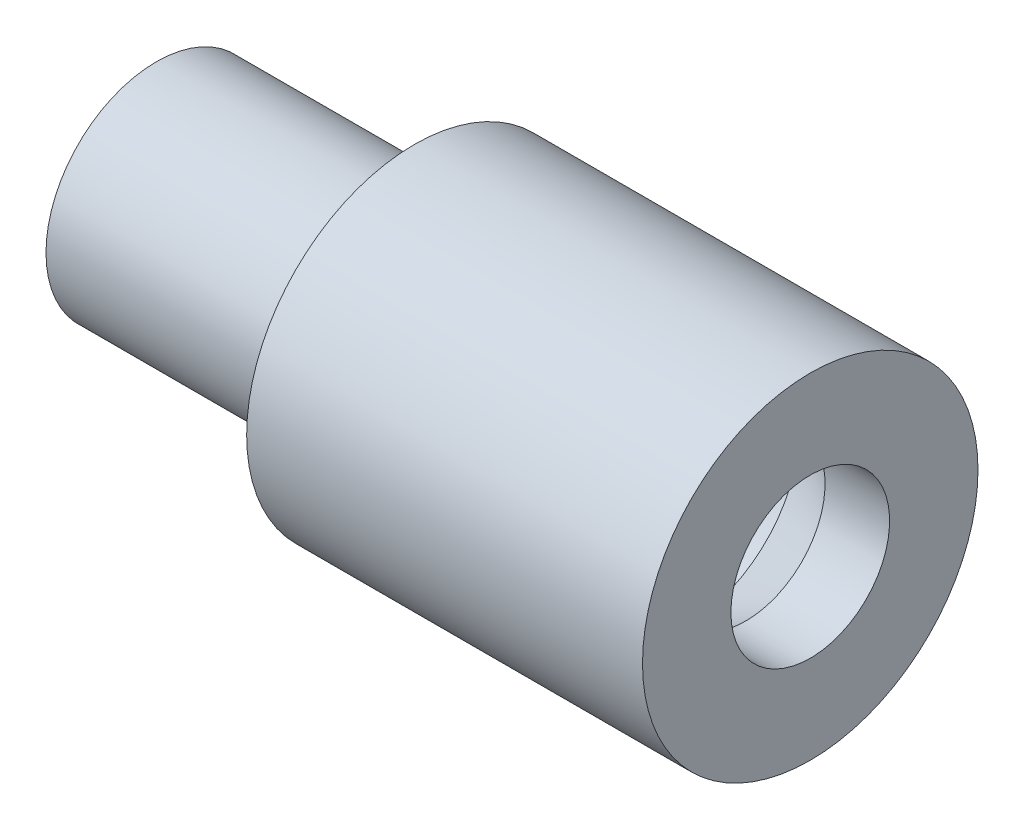
ISO-10303-21;
HEADER;
FILE_DESCRIPTION(('STEP AP214'),'2;1');
FILE_NAME('part.step','',(''),(''),'','','');
FILE_SCHEMA(('AUTOMOTIVE_DESIGN { 1 0 10303 214 1 1 1 1 }'));
ENDSEC;
DATA;
#1=APPLICATION_CONTEXT('core data for automotive mechanical design processes');
#2=APPLICATION_PROTOCOL_DEFINITION('international standard','automotive_design',2000,#1);
#3=PRODUCT_CONTEXT('',#1,'mechanical');
#4=PRODUCT('Part','Part','',(#3));
#5=PRODUCT_RELATED_PRODUCT_CATEGORY('part','',(#4));
#6=PRODUCT_DEFINITION_FORMATION('','',#4);
#7=PRODUCT_DEFINITION_CONTEXT('part definition',#1,'design');
#8=PRODUCT_DEFINITION('design','',#6,#7);
#9=PRODUCT_DEFINITION_SHAPE('','',#8);
#10=(LENGTH_UNIT() NAMED_UNIT(*) SI_UNIT(.MILLI.,.METRE.));
#11=(NAMED_UNIT(*) PLANE_ANGLE_UNIT() SI_UNIT($,.RADIAN.));
#12=(NAMED_UNIT(*) SI_UNIT($,.STERADIAN.) SOLID_ANGLE_UNIT());
#13=UNCERTAINTY_MEASURE_WITH_UNIT(LENGTH_MEASURE(1.E-05),#10,'distance_accuracy_value','');
#14=(GEOMETRIC_REPRESENTATION_CONTEXT(3) GLOBAL_UNCERTAINTY_ASSIGNED_CONTEXT((#13)) GLOBAL_UNIT_ASSIGNED_CONTEXT((#10,
#11,#12)) REPRESENTATION_CONTEXT('',''));
#15=CARTESIAN_POINT('',(0.,0.,0.));
#16=DIRECTION('',(0.,0.,1.));
#17=DIRECTION('',(1.,0.,0.));
#18=AXIS2_PLACEMENT_3D('',#15,#16,#17);
#19=CARTESIAN_POINT('',(0.,0.,0.));
#20=DIRECTION('',(-1.,0.,0.));
#21=DIRECTION('',(0.,0.,1.));
#22=AXIS2_PLACEMENT_3D('',#19,#20,#21);
#23=CYLINDRICAL_SURFACE('',#22,5.15);
#24=CARTESIAN_POINT('',(-1.934375,0.,0.));
#25=DIRECTION('',(-1.,0.,0.));
#26=DIRECTION('',(0.,0.,1.));
#27=AXIS2_PLACEMENT_3D('',#24,#25,#26);
#28=CIRCLE('',#27,5.15);
#29=CARTESIAN_POINT('',(-1.934375,0.,5.15));
#30=VERTEX_POINT('',#29);
#31=EDGE_CURVE('E11',#30,#30,#28,.T.);
#32=ORIENTED_EDGE('',*,*,#31,.F.);
#33=EDGE_LOOP('',(#32));
#34=FACE_BOUND('',#33,.T.);
#35=CARTESIAN_POINT('',(1.934375,0.,0.));
#36=DIRECTION('',(-1.,0.,0.));
#37=DIRECTION('',(0.,0.,1.));
#38=AXIS2_PLACEMENT_3D('',#35,#36,#37);
#39=CIRCLE('',#38,5.15);
#40=CARTESIAN_POINT('',(1.934375,0.,5.15));
#41=VERTEX_POINT('',#40);
#42=EDGE_CURVE('E59',#41,#41,#39,.T.);
#43=ORIENTED_EDGE('',*,*,#42,.T.);
#44=EDGE_LOOP('',(#43));
#45=FACE_BOUND('',#44,.T.);
#46=ADVANCED_FACE('F49',(#34,#45),#23,.T.);
#47=CARTESIAN_POINT('',(-1.934375,0.,0.));
#48=DIRECTION('',(1.,0.,0.));
#49=DIRECTION('',(0.,0.,-1.));
#50=AXIS2_PLACEMENT_3D('',#47,#48,#49);
#51=CONICAL_SURFACE('',#50,5.15,0.412410441597387);
#52=CARTESIAN_POINT('',(-3.934375,0.,0.));
#53=DIRECTION('',(-1.,0.,0.));
#54=DIRECTION('',(0.,0.,1.));
#55=AXIS2_PLACEMENT_3D('',#52,#53,#54);
#56=CIRCLE('',#55,4.275);
#57=CARTESIAN_POINT('',(-3.934375,0.,4.275));
#58=VERTEX_POINT('',#57);
#59=EDGE_CURVE('E55',#58,#58,#56,.T.);
#60=ORIENTED_EDGE('',*,*,#59,.F.);
#61=EDGE_LOOP('',(#60));
#62=FACE_BOUND('',#61,.T.);
#63=ORIENTED_EDGE('',*,*,#31,.T.);
#64=EDGE_LOOP('',(#63));
#65=FACE_BOUND('',#64,.T.);
#66=ADVANCED_FACE('F98',(#62,#65),#51,.T.);
#67=CARTESIAN_POINT('',(0.,0.,0.));
#68=DIRECTION('',(-1.,0.,0.));
#69=DIRECTION('',(0.,0.,1.));
#70=AXIS2_PLACEMENT_3D('',#67,#68,#69);
#71=CYLINDRICAL_SURFACE('',#70,4.275);
#72=ORIENTED_EDGE('',*,*,#59,.T.);
#73=EDGE_LOOP('',(#72));
#74=FACE_BOUND('',#73,.T.);
#75=CARTESIAN_POINT('',(-15.,0.,0.));
#76=DIRECTION('',(1.,0.,0.));
#77=DIRECTION('',(0.,0.,-1.));
#78=AXIS2_PLACEMENT_3D('',#75,#76,#77);
#79=CIRCLE('',#78,4.275);
#80=CARTESIAN_POINT('',(-15.,0.,-4.275));
#81=VERTEX_POINT('',#80);
#82=EDGE_CURVE('E74',#81,#81,#79,.T.);
#83=ORIENTED_EDGE('',*,*,#82,.T.);
#84=EDGE_LOOP('',(#83));
#85=FACE_BOUND('',#84,.T.);
#86=ADVANCED_FACE('F87',(#74,#85),#71,.T.);
#87=CARTESIAN_POINT('',(0.,0.,0.));
#88=DIRECTION('',(-1.,0.,0.));
#89=DIRECTION('',(0.,0.,1.));
#90=AXIS2_PLACEMENT_3D('',#87,#88,#89);
#91=CYLINDRICAL_SURFACE('',#90,3.075);
#92=CARTESIAN_POINT('',(5.,0.,0.));
#93=DIRECTION('',(-1.,0.,0.));
#94=DIRECTION('',(0.,0.,1.));
#95=AXIS2_PLACEMENT_3D('',#92,#93,#94);
#96=CIRCLE('',#95,3.075);
#97=CARTESIAN_POINT('',(5.,0.,3.075));
#98=VERTEX_POINT('',#97);
#99=EDGE_CURVE('E71',#98,#98,#96,.T.);
#100=ORIENTED_EDGE('',*,*,#99,.F.);
#101=EDGE_LOOP('',(#100));
#102=FACE_BOUND('',#101,.T.);
#103=CARTESIAN_POINT('',(-15.,0.,0.));
#104=DIRECTION('',(1.,0.,0.));
#105=DIRECTION('',(0.,0.,-1.));
#106=AXIS2_PLACEMENT_3D('',#103,#104,#105);
#107=CIRCLE('',#106,3.075);
#108=CARTESIAN_POINT('',(-15.,0.,-3.075));
#109=VERTEX_POINT('',#108);
#110=EDGE_CURVE('E77',#109,#109,#107,.T.);
#111=ORIENTED_EDGE('',*,*,#110,.F.);
#112=EDGE_LOOP('',(#111));
#113=FACE_BOUND('',#112,.T.);
#114=ADVANCED_FACE('F84',(#102,#113),#91,.F.);
#115=CARTESIAN_POINT('',(1.934375,0.,0.));
#116=DIRECTION('',(-1.,0.,0.));
#117=DIRECTION('',(0.,0.,-1.));
#118=AXIS2_PLACEMENT_3D('',#115,#116,#117);
#119=CONICAL_SURFACE('',#118,5.15,0.412410441597387);
#120=CARTESIAN_POINT('',(3.934375,0.,0.));
#121=DIRECTION('',(-1.,0.,0.));
#122=DIRECTION('',(0.,0.,1.));
#123=AXIS2_PLACEMENT_3D('',#120,#121,#122);
#124=CIRCLE('',#123,4.275);
#125=CARTESIAN_POINT('',(3.934375,0.,4.275));
#126=VERTEX_POINT('',#125);
#127=EDGE_CURVE('E63',#126,#126,#124,.T.);
#128=ORIENTED_EDGE('',*,*,#127,.T.);
#129=EDGE_LOOP('',(#128));
#130=FACE_BOUND('',#129,.T.);
#131=ORIENTED_EDGE('',*,*,#42,.F.);
#132=EDGE_LOOP('',(#131));
#133=FACE_BOUND('',#132,.T.);
#134=ADVANCED_FACE('F86',(#130,#133),#119,.T.);
#135=CARTESIAN_POINT('',(0.,0.,0.));
#136=DIRECTION('',(1.,0.,0.));
#137=DIRECTION('',(0.,0.,1.));
#138=AXIS2_PLACEMENT_3D('',#135,#136,#137);
#139=CYLINDRICAL_SURFACE('',#138,4.275);
#140=CARTESIAN_POINT('',(5.,0.,0.));
#141=DIRECTION('',(-1.,0.,0.));
#142=DIRECTION('',(0.,0.,1.));
#143=AXIS2_PLACEMENT_3D('',#140,#141,#142);
#144=CIRCLE('',#143,4.275);
#145=CARTESIAN_POINT('',(5.,0.,4.275));
#146=VERTEX_POINT('',#145);
#147=EDGE_CURVE('E68',#146,#146,#144,.T.);
#148=ORIENTED_EDGE('',*,*,#147,.T.);
#149=EDGE_LOOP('',(#148));
#150=FACE_BOUND('',#149,.T.);
#151=ORIENTED_EDGE('',*,*,#127,.F.);
#152=EDGE_LOOP('',(#151));
#153=FACE_BOUND('',#152,.T.);
#154=ADVANCED_FACE('F95',(#150,#153),#139,.T.);
#155=CARTESIAN_POINT('',(5.,0.,-4.275));
#156=DIRECTION('',(-1.,0.,0.));
#157=DIRECTION('',(0.,0.,-1.));
#158=AXIS2_PLACEMENT_3D('',#155,#156,#157);
#159=PLANE('',#158);
#160=ORIENTED_EDGE('',*,*,#99,.T.);
#161=EDGE_LOOP('',(#160));
#162=FACE_BOUND('',#161,.T.);
#163=ORIENTED_EDGE('',*,*,#147,.F.);
#164=EDGE_LOOP('',(#163));
#165=FACE_BOUND('',#164,.T.);
#166=ADVANCED_FACE('F147',(#162,#165),#159,.F.);
#167=CARTESIAN_POINT('',(-15.,0.,0.));
#168=DIRECTION('',(-1.,0.,0.));
#169=DIRECTION('',(0.,0.,1.));
#170=AXIS2_PLACEMENT_3D('',#167,#168,#169);
#171=PLANE('',#170);
#172=ORIENTED_EDGE('',*,*,#110,.T.);
#173=EDGE_LOOP('',(#172));
#174=FACE_BOUND('',#173,.T.);
#175=ORIENTED_EDGE('',*,*,#82,.F.);
#176=EDGE_LOOP('',(#175));
#177=FACE_BOUND('',#176,.T.);
#178=ADVANCED_FACE('F81',(#174,#177),#171,.T.);
#179=CLOSED_SHELL('',(#46,#66,#86,#114,#134,#154,#166,#178));
#180=MANIFOLD_SOLID_BREP('B2',#179);
#181=CARTESIAN_POINT('',(0.,0.,0.));
#182=DIRECTION('',(-1.,0.,0.));
#183=DIRECTION('',(0.,0.,1.));
#184=AXIS2_PLACEMENT_3D('',#181,#182,#183);
#185=CYLINDRICAL_SURFACE('',#184,5.3);
#186=CARTESIAN_POINT('',(-2.,0.,0.));
#187=DIRECTION('',(-1.,0.,0.));
#188=DIRECTION('',(0.,0.,1.));
#189=AXIS2_PLACEMENT_3D('',#186,#187,#188);
#190=CIRCLE('',#189,5.3);
#191=CARTESIAN_POINT('',(-2.,0.,5.3));
#192=VERTEX_POINT('',#191);
#193=EDGE_CURVE('E48',#192,#192,#190,.T.);
#194=ORIENTED_EDGE('',*,*,#193,.T.);
#195=EDGE_LOOP('',(#194));
#196=FACE_BOUND('',#195,.T.);
#197=CARTESIAN_POINT('',(2.,0.,0.));
#198=DIRECTION('',(-1.,0.,0.));
#199=DIRECTION('',(0.,0.,1.));
#200=AXIS2_PLACEMENT_3D('',#197,#198,#199);
#201=CIRCLE('',#200,5.3);
#202=CARTESIAN_POINT('',(2.,0.,5.3));
#203=VERTEX_POINT('',#202);
#204=EDGE_CURVE('E196',#203,#203,#201,.T.);
#205=ORIENTED_EDGE('',*,*,#204,.F.);
#206=EDGE_LOOP('',(#205));
#207=FACE_BOUND('',#206,.T.);
#208=ADVANCED_FACE('F177',(#196,#207),#185,.F.);
#209=CARTESIAN_POINT('',(-4.,0.,0.));
#210=DIRECTION('',(1.,0.,0.));
#211=DIRECTION('',(0.,0.,-1.));
#212=AXIS2_PLACEMENT_3D('',#209,#210,#211);
#213=CONICAL_SURFACE('',#212,4.425,0.412410441597387);
#214=ORIENTED_EDGE('',*,*,#193,.F.);
#215=EDGE_LOOP('',(#214));
#216=FACE_BOUND('',#215,.T.);
#217=CARTESIAN_POINT('',(-4.,0.,0.));
#218=DIRECTION('',(-1.,0.,0.));
#219=DIRECTION('',(0.,0.,1.));
#220=AXIS2_PLACEMENT_3D('',#217,#218,#219);
#221=CIRCLE('',#220,4.425);
#222=CARTESIAN_POINT('',(-4.,0.,4.425));
#223=VERTEX_POINT('',#222);
#224=EDGE_CURVE('E183',#223,#223,#221,.T.);
#225=ORIENTED_EDGE('',*,*,#224,.T.);
#226=EDGE_LOOP('',(#225));
#227=FACE_BOUND('',#226,.T.);
#228=ADVANCED_FACE('F247',(#216,#227),#213,.F.);
#229=CARTESIAN_POINT('',(0.,0.,0.));
#230=DIRECTION('',(-1.,0.,0.));
#231=DIRECTION('',(0.,0.,1.));
#232=AXIS2_PLACEMENT_3D('',#229,#230,#231);
#233=CYLINDRICAL_SURFACE('',#232,4.425);
#234=ORIENTED_EDGE('',*,*,#224,.F.);
#235=EDGE_LOOP('',(#234));
#236=FACE_BOUND('',#235,.T.);
#237=CARTESIAN_POINT('',(-5.,0.,0.));
#238=DIRECTION('',(-1.,0.,0.));
#239=DIRECTION('',(0.,0.,1.));
#240=AXIS2_PLACEMENT_3D('',#237,#238,#239);
#241=CIRCLE('',#240,4.425);
#242=CARTESIAN_POINT('',(-5.,0.,4.425));
#243=VERTEX_POINT('',#242);
#244=EDGE_CURVE('E187',#243,#243,#241,.T.);
#245=ORIENTED_EDGE('',*,*,#244,.T.);
#246=EDGE_LOOP('',(#245));
#247=FACE_BOUND('',#246,.T.);
#248=ADVANCED_FACE('F252',(#236,#247),#233,.F.);
#249=CARTESIAN_POINT('',(-5.,0.,-4.425));
#250=DIRECTION('',(1.,0.,0.));
#251=DIRECTION('',(0.,0.,-1.));
#252=AXIS2_PLACEMENT_3D('',#249,#250,#251);
#253=PLANE('',#252);
#254=ORIENTED_EDGE('',*,*,#244,.F.);
#255=EDGE_LOOP('',(#254));
#256=FACE_BOUND('',#255,.T.);
#257=CARTESIAN_POINT('',(-5.,0.,0.));
#258=DIRECTION('',(-1.,0.,0.));
#259=DIRECTION('',(0.,0.,1.));
#260=AXIS2_PLACEMENT_3D('',#257,#258,#259);
#261=CIRCLE('',#260,6.5);
#262=CARTESIAN_POINT('',(-5.,0.,6.5));
#263=VERTEX_POINT('',#262);
#264=EDGE_CURVE('E191',#263,#263,#261,.T.);
#265=ORIENTED_EDGE('',*,*,#264,.T.);
#266=EDGE_LOOP('',(#265));
#267=FACE_BOUND('',#266,.T.);
#268=ADVANCED_FACE('F261',(#256,#267),#253,.F.);
#269=CARTESIAN_POINT('',(0.,0.,0.));
#270=DIRECTION('',(-1.,0.,0.));
#271=DIRECTION('',(0.,0.,1.));
#272=AXIS2_PLACEMENT_3D('',#269,#270,#271);
#273=CYLINDRICAL_SURFACE('',#272,6.5);
#274=ORIENTED_EDGE('',*,*,#264,.F.);
#275=EDGE_LOOP('',(#274));
#276=FACE_BOUND('',#275,.T.);
#277=CARTESIAN_POINT('',(10.338268590218,0.,0.));
#278=DIRECTION('',(-1.,0.,0.));
#279=DIRECTION('',(0.,0.,1.));
#280=AXIS2_PLACEMENT_3D('',#277,#278,#279);
#281=CIRCLE('',#280,6.5);
#282=CARTESIAN_POINT('',(10.338268590218,0.,6.5));
#283=VERTEX_POINT('',#282);
#284=EDGE_CURVE('E211',#283,#283,#281,.T.);
#285=ORIENTED_EDGE('',*,*,#284,.T.);
#286=EDGE_LOOP('',(#285));
#287=FACE_BOUND('',#286,.T.);
#288=ADVANCED_FACE('F215',(#276,#287),#273,.T.);
#289=CARTESIAN_POINT('',(4.,0.,0.));
#290=DIRECTION('',(-1.,0.,0.));
#291=DIRECTION('',(0.,0.,-1.));
#292=AXIS2_PLACEMENT_3D('',#289,#290,#291);
#293=CONICAL_SURFACE('',#292,4.425,0.412410441597387);
#294=ORIENTED_EDGE('',*,*,#204,.T.);
#295=EDGE_LOOP('',(#294));
#296=FACE_BOUND('',#295,.T.);
#297=CARTESIAN_POINT('',(4.,0.,0.));
#298=DIRECTION('',(-1.,0.,0.));
#299=DIRECTION('',(0.,0.,1.));
#300=AXIS2_PLACEMENT_3D('',#297,#298,#299);
#301=CIRCLE('',#300,4.425);
#302=CARTESIAN_POINT('',(4.,0.,4.425));
#303=VERTEX_POINT('',#302);
#304=EDGE_CURVE('E199',#303,#303,#301,.T.);
#305=ORIENTED_EDGE('',*,*,#304,.F.);
#306=EDGE_LOOP('',(#305));
#307=FACE_BOUND('',#306,.T.);
#308=ADVANCED_FACE('F237',(#296,#307),#293,.F.);
#309=CARTESIAN_POINT('',(0.,0.,0.));
#310=DIRECTION('',(1.,0.,0.));
#311=DIRECTION('',(0.,0.,1.));
#312=AXIS2_PLACEMENT_3D('',#309,#310,#311);
#313=CYLINDRICAL_SURFACE('',#312,4.425);
#314=ORIENTED_EDGE('',*,*,#304,.T.);
#315=EDGE_LOOP('',(#314));
#316=FACE_BOUND('',#315,.T.);
#317=CARTESIAN_POINT('',(5.5,0.,0.));
#318=DIRECTION('',(-1.,0.,0.));
#319=DIRECTION('',(0.,0.,1.));
#320=AXIS2_PLACEMENT_3D('',#317,#318,#319);
#321=CIRCLE('',#320,4.425);
#322=CARTESIAN_POINT('',(5.5,0.,4.425));
#323=VERTEX_POINT('',#322);
#324=EDGE_CURVE('E202',#323,#323,#321,.T.);
#325=ORIENTED_EDGE('',*,*,#324,.F.);
#326=EDGE_LOOP('',(#325));
#327=FACE_BOUND('',#326,.T.);
#328=ADVANCED_FACE('F232',(#316,#327),#313,.F.);
#329=CARTESIAN_POINT('',(5.5,0.,0.));
#330=DIRECTION('',(-1.,0.,0.));
#331=DIRECTION('',(0.,0.,1.));
#332=AXIS2_PLACEMENT_3D('',#329,#330,#331);
#333=CONICAL_SURFACE('',#332,4.425,0.5235987755983);
#334=CARTESIAN_POINT('',(7.83826859021797,0.,0.));
#335=DIRECTION('',(-1.,0.,0.));
#336=DIRECTION('',(0.,0.,1.));
#337=AXIS2_PLACEMENT_3D('',#334,#335,#336);
#338=CIRCLE('',#337,3.075);
#339=CARTESIAN_POINT('',(7.83826859021797,0.,3.075));
#340=VERTEX_POINT('',#339);
#341=EDGE_CURVE('E205',#340,#340,#338,.T.);
#342=ORIENTED_EDGE('',*,*,#341,.F.);
#343=EDGE_LOOP('',(#342));
#344=FACE_BOUND('',#343,.T.);
#345=ORIENTED_EDGE('',*,*,#324,.T.);
#346=EDGE_LOOP('',(#345));
#347=FACE_BOUND('',#346,.T.);
#348=ADVANCED_FACE('F226',(#344,#347),#333,.F.);
#349=CARTESIAN_POINT('',(0.,0.,0.));
#350=DIRECTION('',(-1.,0.,0.));
#351=DIRECTION('',(0.,0.,1.));
#352=AXIS2_PLACEMENT_3D('',#349,#350,#351);
#353=CYLINDRICAL_SURFACE('',#352,3.075);
#354=CARTESIAN_POINT('',(10.338268590218,0.,0.));
#355=DIRECTION('',(-1.,0.,0.));
#356=DIRECTION('',(0.,0.,1.));
#357=AXIS2_PLACEMENT_3D('',#354,#355,#356);
#358=CIRCLE('',#357,3.075);
#359=CARTESIAN_POINT('',(10.338268590218,0.,3.075));
#360=VERTEX_POINT('',#359);
#361=EDGE_CURVE('E208',#360,#360,#358,.T.);
#362=ORIENTED_EDGE('',*,*,#361,.F.);
#363=EDGE_LOOP('',(#362));
#364=FACE_BOUND('',#363,.T.);
#365=ORIENTED_EDGE('',*,*,#341,.T.);
#366=EDGE_LOOP('',(#365));
#367=FACE_BOUND('',#366,.T.);
#368=ADVANCED_FACE('F220',(#364,#367),#353,.F.);
#369=CARTESIAN_POINT('',(10.338268590218,0.,0.));
#370=DIRECTION('',(-1.,0.,0.));
#371=DIRECTION('',(0.,0.,1.));
#372=AXIS2_PLACEMENT_3D('',#369,#370,#371);
#373=PLANE('',#372);
#374=ORIENTED_EDGE('',*,*,#284,.F.);
#375=EDGE_LOOP('',(#374));
#376=FACE_BOUND('',#375,.T.);
#377=ORIENTED_EDGE('',*,*,#361,.T.);
#378=EDGE_LOOP('',(#377));
#379=FACE_BOUND('',#378,.T.);
#380=ADVANCED_FACE('F217',(#376,#379),#373,.F.);
#381=CLOSED_SHELL('',(#208,#228,#248,#268,#288,#308,#328,#348,#368,#380));
#382=MANIFOLD_SOLID_BREP('B6_NOT_SHOWN',#381);
#383=ADVANCED_BREP_SHAPE_REPRESENTATION('',(#18,#180,#382),#14);
#384=SHAPE_DEFINITION_REPRESENTATION(#9,#383);
ENDSEC;
END-ISO-10303-21;
